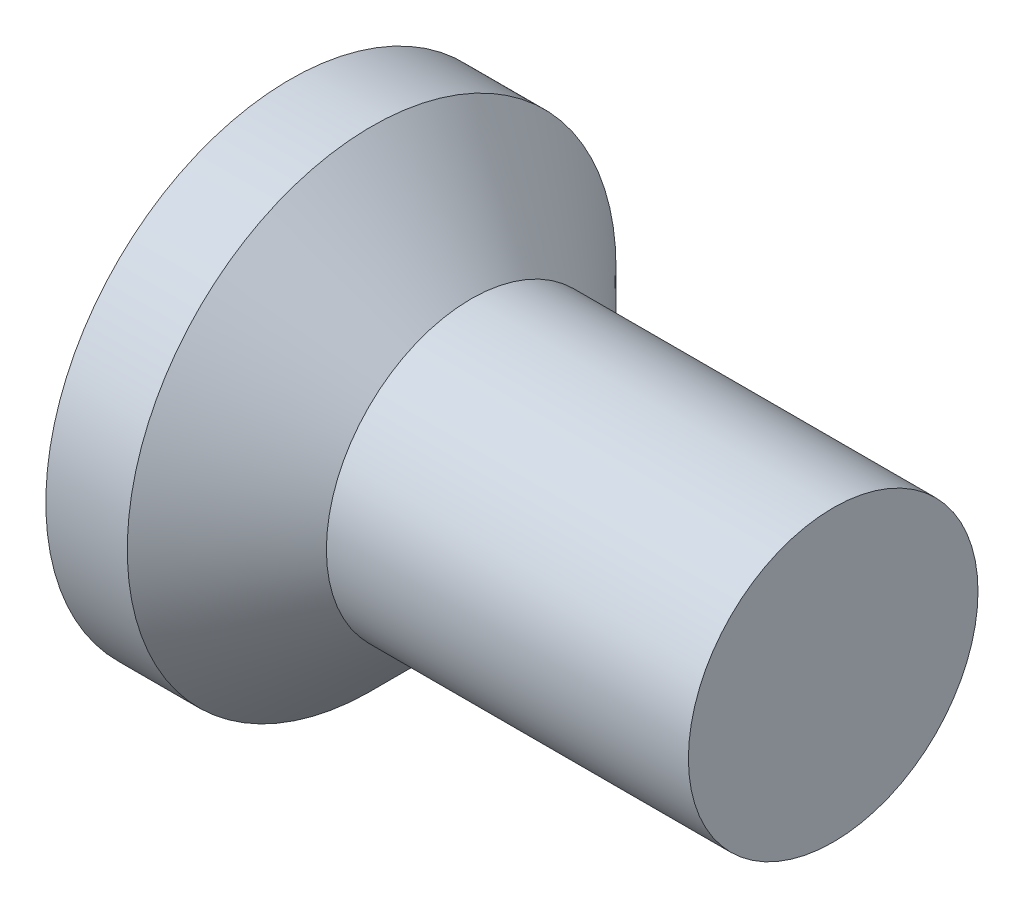
ISO-10303-21;
HEADER;
FILE_DESCRIPTION(('STEP AP214'),'2;1');
FILE_NAME('part.step','',(''),(''),'','','');
FILE_SCHEMA(('AUTOMOTIVE_DESIGN { 1 0 10303 214 1 1 1 1 }'));
ENDSEC;
DATA;
#1=APPLICATION_CONTEXT('core data for automotive mechanical design processes');
#2=APPLICATION_PROTOCOL_DEFINITION('international standard','automotive_design',2000,#1);
#3=PRODUCT_CONTEXT('',#1,'mechanical');
#4=PRODUCT('Part','Part','',(#3));
#5=PRODUCT_RELATED_PRODUCT_CATEGORY('part','',(#4));
#6=PRODUCT_DEFINITION_FORMATION('','',#4);
#7=PRODUCT_DEFINITION_CONTEXT('part definition',#1,'design');
#8=PRODUCT_DEFINITION('design','',#6,#7);
#9=PRODUCT_DEFINITION_SHAPE('','',#8);
#10=(LENGTH_UNIT() NAMED_UNIT(*) SI_UNIT(.MILLI.,.METRE.));
#11=(NAMED_UNIT(*) PLANE_ANGLE_UNIT() SI_UNIT($,.RADIAN.));
#12=(NAMED_UNIT(*) SI_UNIT($,.STERADIAN.) SOLID_ANGLE_UNIT());
#13=UNCERTAINTY_MEASURE_WITH_UNIT(LENGTH_MEASURE(1.E-05),#10,'distance_accuracy_value','');
#14=(GEOMETRIC_REPRESENTATION_CONTEXT(3) GLOBAL_UNCERTAINTY_ASSIGNED_CONTEXT((#13)) GLOBAL_UNIT_ASSIGNED_CONTEXT((#10,
#11,#12)) REPRESENTATION_CONTEXT('',''));
#15=CARTESIAN_POINT('',(0.,0.,0.));
#16=DIRECTION('',(0.,0.,1.));
#17=DIRECTION('',(1.,0.,0.));
#18=AXIS2_PLACEMENT_3D('',#15,#16,#17);
#19=CARTESIAN_POINT('',(0.,1.34999999999999,0.));
#20=DIRECTION('',(-1.,0.,0.));
#21=DIRECTION('',(0.,0.,1.));
#22=AXIS2_PLACEMENT_3D('',#19,#20,#21);
#23=PLANE('',#22);
#24=CARTESIAN_POINT('',(0.,0.,0.));
#25=DIRECTION('',(1.,0.,0.));
#26=DIRECTION('',(0.,0.,-1.));
#27=AXIS2_PLACEMENT_3D('',#24,#25,#26);
#28=CIRCLE('',#27,1.34999999999999);
#29=CARTESIAN_POINT('',(0.,0.,-1.34999999999999));
#30=VERTEX_POINT('',#29);
#31=EDGE_CURVE('E186',#30,#30,#28,.T.);
#32=ORIENTED_EDGE('',*,*,#31,.F.);
#33=EDGE_LOOP('',(#32));
#34=FACE_BOUND('',#33,.T.);
#35=DIRECTION('',(0.,1.,0.));
#36=VECTOR('',#35,1.);
#37=CARTESIAN_POINT('',(0.,-0.16,-0.16));
#38=LINE('',#37,#36);
#39=CARTESIAN_POINT('',(0.,-0.8,-0.16));
#40=VERTEX_POINT('',#39);
#41=CARTESIAN_POINT('',(0.,-0.46,-0.16));
#42=VERTEX_POINT('',#41);
#43=EDGE_CURVE('E312',#40,#42,#38,.T.);
#44=ORIENTED_EDGE('',*,*,#43,.T.);
#45=CARTESIAN_POINT('',(0.,-0.46,-0.46));
#46=DIRECTION('',(-1.,0.,0.));
#47=DIRECTION('',(0.,0.,1.));
#48=AXIS2_PLACEMENT_3D('',#45,#46,#47);
#49=CIRCLE('',#48,0.3);
#50=CARTESIAN_POINT('',(0.,-0.16,-0.46));
#51=VERTEX_POINT('',#50);
#52=EDGE_CURVE('E191',#42,#51,#49,.T.);
#53=ORIENTED_EDGE('',*,*,#52,.T.);
#54=DIRECTION('',(0.,0.,-1.));
#55=VECTOR('',#54,1.);
#56=CARTESIAN_POINT('',(0.,-0.16,-0.16));
#57=LINE('',#56,#55);
#58=CARTESIAN_POINT('',(0.,-0.16,-0.8));
#59=VERTEX_POINT('',#58);
#60=EDGE_CURVE('E314',#51,#59,#57,.T.);
#61=ORIENTED_EDGE('',*,*,#60,.T.);
#62=DIRECTION('',(0.,1.,0.));
#63=VECTOR('',#62,1.);
#64=CARTESIAN_POINT('',(0.,0.16,-0.8));
#65=LINE('',#64,#63);
#66=CARTESIAN_POINT('',(0.,0.16,-0.8));
#67=VERTEX_POINT('',#66);
#68=EDGE_CURVE('E316',#59,#67,#65,.T.);
#69=ORIENTED_EDGE('',*,*,#68,.T.);
#70=DIRECTION('',(0.,0.,1.));
#71=VECTOR('',#70,1.);
#72=CARTESIAN_POINT('',(0.,0.16,-0.16));
#73=LINE('',#72,#71);
#74=CARTESIAN_POINT('',(0.,0.16,-0.46));
#75=VERTEX_POINT('',#74);
#76=EDGE_CURVE('E319',#67,#75,#73,.T.);
#77=ORIENTED_EDGE('',*,*,#76,.T.);
#78=CARTESIAN_POINT('',(0.,0.46,-0.46));
#79=DIRECTION('',(-1.,0.,0.));
#80=DIRECTION('',(0.,0.,1.));
#81=AXIS2_PLACEMENT_3D('',#78,#79,#80);
#82=CIRCLE('',#81,0.3);
#83=CARTESIAN_POINT('',(0.,0.46,-0.16));
#84=VERTEX_POINT('',#83);
#85=EDGE_CURVE('E189',#75,#84,#82,.T.);
#86=ORIENTED_EDGE('',*,*,#85,.T.);
#87=DIRECTION('',(0.,1.,0.));
#88=VECTOR('',#87,1.);
#89=CARTESIAN_POINT('',(0.,0.16,-0.16));
#90=LINE('',#89,#88);
#91=CARTESIAN_POINT('',(0.,0.8,-0.16));
#92=VERTEX_POINT('',#91);
#93=EDGE_CURVE('E322',#84,#92,#90,.T.);
#94=ORIENTED_EDGE('',*,*,#93,.T.);
#95=DIRECTION('',(0.,0.,1.));
#96=VECTOR('',#95,1.);
#97=CARTESIAN_POINT('',(0.,0.8,-0.16));
#98=LINE('',#97,#96);
#99=CARTESIAN_POINT('',(0.,0.8,0.16));
#100=VERTEX_POINT('',#99);
#101=EDGE_CURVE('E324',#92,#100,#98,.T.);
#102=ORIENTED_EDGE('',*,*,#101,.T.);
#103=DIRECTION('',(0.,-1.,0.));
#104=VECTOR('',#103,1.);
#105=CARTESIAN_POINT('',(0.,0.16,0.16));
#106=LINE('',#105,#104);
#107=CARTESIAN_POINT('',(0.,0.46,0.16));
#108=VERTEX_POINT('',#107);
#109=EDGE_CURVE('E327',#100,#108,#106,.T.);
#110=ORIENTED_EDGE('',*,*,#109,.T.);
#111=CARTESIAN_POINT('',(0.,0.46,0.46));
#112=DIRECTION('',(-1.,0.,0.));
#113=DIRECTION('',(0.,0.,1.));
#114=AXIS2_PLACEMENT_3D('',#111,#112,#113);
#115=CIRCLE('',#114,0.3);
#116=CARTESIAN_POINT('',(0.,0.16,0.46));
#117=VERTEX_POINT('',#116);
#118=EDGE_CURVE('E154',#108,#117,#115,.T.);
#119=ORIENTED_EDGE('',*,*,#118,.T.);
#120=DIRECTION('',(0.,0.,1.));
#121=VECTOR('',#120,1.);
#122=CARTESIAN_POINT('',(0.,0.16,0.16));
#123=LINE('',#122,#121);
#124=CARTESIAN_POINT('',(0.,0.16,0.8));
#125=VERTEX_POINT('',#124);
#126=EDGE_CURVE('E148',#117,#125,#123,.T.);
#127=ORIENTED_EDGE('',*,*,#126,.T.);
#128=DIRECTION('',(0.,-1.,0.));
#129=VECTOR('',#128,1.);
#130=CARTESIAN_POINT('',(0.,0.16,0.8));
#131=LINE('',#130,#129);
#132=CARTESIAN_POINT('',(0.,-0.16,0.8));
#133=VERTEX_POINT('',#132);
#134=EDGE_CURVE('E152',#125,#133,#131,.T.);
#135=ORIENTED_EDGE('',*,*,#134,.T.);
#136=DIRECTION('',(0.,0.,-1.));
#137=VECTOR('',#136,1.);
#138=CARTESIAN_POINT('',(0.,-0.16,0.16));
#139=LINE('',#138,#137);
#140=CARTESIAN_POINT('',(0.,-0.16,0.46));
#141=VERTEX_POINT('',#140);
#142=EDGE_CURVE('E166',#133,#141,#139,.T.);
#143=ORIENTED_EDGE('',*,*,#142,.T.);
#144=CARTESIAN_POINT('',(0.,-0.46,0.46));
#145=DIRECTION('',(-1.,0.,0.));
#146=DIRECTION('',(0.,0.,1.));
#147=AXIS2_PLACEMENT_3D('',#144,#145,#146);
#148=CIRCLE('',#147,0.3);
#149=CARTESIAN_POINT('',(0.,-0.46,0.16));
#150=VERTEX_POINT('',#149);
#151=EDGE_CURVE('E185',#141,#150,#148,.T.);
#152=ORIENTED_EDGE('',*,*,#151,.T.);
#153=DIRECTION('',(0.,-1.,0.));
#154=VECTOR('',#153,1.);
#155=CARTESIAN_POINT('',(0.,-0.16,0.16));
#156=LINE('',#155,#154);
#157=CARTESIAN_POINT('',(0.,-0.8,0.159999999999999));
#158=VERTEX_POINT('',#157);
#159=EDGE_CURVE('E307',#150,#158,#156,.T.);
#160=ORIENTED_EDGE('',*,*,#159,.T.);
#161=DIRECTION('',(0.,0.,-1.));
#162=VECTOR('',#161,1.);
#163=CARTESIAN_POINT('',(0.,-0.8,-0.16));
#164=LINE('',#163,#162);
#165=EDGE_CURVE('E309',#158,#40,#164,.T.);
#166=ORIENTED_EDGE('',*,*,#165,.T.);
#167=EDGE_LOOP('',(#44,#53,#61,#69,#77,#86,#94,#102,#110,#119,#127,#135,#143,#152,#160,#166));
#168=FACE_BOUND('',#167,.T.);
#169=ADVANCED_FACE('F35',(#34,#168),#23,.T.);
#170=CARTESIAN_POINT('',(3.,0.799999999999993,0.));
#171=DIRECTION('',(1.,0.,0.));
#172=DIRECTION('',(0.,0.,-1.));
#173=AXIS2_PLACEMENT_3D('',#170,#171,#172);
#174=PLANE('',#173);
#175=CARTESIAN_POINT('',(3.,0.,0.));
#176=DIRECTION('',(1.,0.,0.));
#177=DIRECTION('',(0.,0.,-1.));
#178=AXIS2_PLACEMENT_3D('',#175,#176,#177);
#179=CIRCLE('',#178,0.799999999999993);
#180=CARTESIAN_POINT('',(3.,0.,-0.799999999999993));
#181=VERTEX_POINT('',#180);
#182=EDGE_CURVE('E172',#181,#181,#179,.T.);
#183=ORIENTED_EDGE('',*,*,#182,.T.);
#184=EDGE_LOOP('',(#183));
#185=FACE_BOUND('',#184,.T.);
#186=ADVANCED_FACE('F239',(#185),#174,.T.);
#187=CARTESIAN_POINT('',(4.51581291088132,0.,0.));
#188=DIRECTION('',(1.,0.,0.));
#189=DIRECTION('',(0.,0.,-1.));
#190=AXIS2_PLACEMENT_3D('',#187,#188,#189);
#191=CYLINDRICAL_SURFACE('',#190,1.34999999999999);
#192=ORIENTED_EDGE('',*,*,#31,.T.);
#193=EDGE_LOOP('',(#192));
#194=FACE_BOUND('',#193,.T.);
#195=CARTESIAN_POINT('',(0.450000000000002,0.,0.));
#196=DIRECTION('',(1.,0.,0.));
#197=DIRECTION('',(0.,0.,-1.));
#198=AXIS2_PLACEMENT_3D('',#195,#196,#197);
#199=CIRCLE('',#198,1.34999999999999);
#200=CARTESIAN_POINT('',(0.450000000000002,0.,-1.34999999999999));
#201=VERTEX_POINT('',#200);
#202=EDGE_CURVE('E331',#201,#201,#199,.T.);
#203=ORIENTED_EDGE('',*,*,#202,.F.);
#204=EDGE_LOOP('',(#203));
#205=FACE_BOUND('',#204,.T.);
#206=ADVANCED_FACE('F245',(#194,#205),#191,.T.);
#207=CARTESIAN_POINT('',(1.,0.,0.));
#208=DIRECTION('',(-1.,0.,0.));
#209=DIRECTION('',(0.,0.,1.));
#210=AXIS2_PLACEMENT_3D('',#207,#208,#209);
#211=CONICAL_SURFACE('',#210,0.799999999999993,0.785398163397449);
#212=ORIENTED_EDGE('',*,*,#202,.T.);
#213=EDGE_LOOP('',(#212));
#214=FACE_BOUND('',#213,.T.);
#215=CARTESIAN_POINT('',(1.,0.,0.));
#216=DIRECTION('',(1.,0.,0.));
#217=DIRECTION('',(0.,0.,-1.));
#218=AXIS2_PLACEMENT_3D('',#215,#216,#217);
#219=CIRCLE('',#218,0.799999999999993);
#220=CARTESIAN_POINT('',(1.,0.,-0.799999999999993));
#221=VERTEX_POINT('',#220);
#222=EDGE_CURVE('E175',#221,#221,#219,.T.);
#223=ORIENTED_EDGE('',*,*,#222,.F.);
#224=EDGE_LOOP('',(#223));
#225=FACE_BOUND('',#224,.T.);
#226=ADVANCED_FACE('F367',(#214,#225),#211,.T.);
#227=CARTESIAN_POINT('',(4.51581291088132,0.,0.));
#228=DIRECTION('',(1.,0.,0.));
#229=DIRECTION('',(0.,0.,-1.));
#230=AXIS2_PLACEMENT_3D('',#227,#228,#229);
#231=CYLINDRICAL_SURFACE('',#230,0.799999999999993);
#232=ORIENTED_EDGE('',*,*,#222,.T.);
#233=EDGE_LOOP('',(#232));
#234=FACE_BOUND('',#233,.T.);
#235=ORIENTED_EDGE('',*,*,#182,.F.);
#236=EDGE_LOOP('',(#235));
#237=FACE_BOUND('',#236,.T.);
#238=ADVANCED_FACE('F365',(#234,#237),#231,.T.);
#239=CARTESIAN_POINT('',(0.5,0.16,0.16));
#240=DIRECTION('',(0.,-1.,0.));
#241=DIRECTION('',(0.,0.,-1.));
#242=AXIS2_PLACEMENT_3D('',#239,#240,#241);
#243=PLANE('',#242);
#244=ORIENTED_EDGE('',*,*,#126,.F.);
#245=DIRECTION('',(-1.,0.,0.));
#246=VECTOR('',#245,1.);
#247=CARTESIAN_POINT('',(0.5,0.16,0.46));
#248=LINE('',#247,#246);
#249=CARTESIAN_POINT('',(0.5,0.16,0.46));
#250=VERTEX_POINT('',#249);
#251=EDGE_CURVE('E203',#117,#250,#248,.F.);
#252=ORIENTED_EDGE('',*,*,#251,.T.);
#253=DIRECTION('',(0.,0.,1.));
#254=VECTOR('',#253,1.);
#255=CARTESIAN_POINT('',(0.5,0.16,0.16));
#256=LINE('',#255,#254);
#257=CARTESIAN_POINT('',(0.5,0.16,0.511324865405187));
#258=VERTEX_POINT('',#257);
#259=EDGE_CURVE('E170',#250,#258,#256,.T.);
#260=ORIENTED_EDGE('',*,*,#259,.T.);
#261=DIRECTION('',(-0.866025403784438,0.,0.500000000000001));
#262=VECTOR('',#261,1.);
#263=CARTESIAN_POINT('',(0.,0.16,0.8));
#264=LINE('',#263,#262);
#265=EDGE_CURVE('E162',#258,#125,#264,.T.);
#266=ORIENTED_EDGE('',*,*,#265,.T.);
#267=EDGE_LOOP('',(#244,#252,#260,#266));
#268=FACE_BOUND('',#267,.T.);
#269=ADVANCED_FACE('F168',(#268),#243,.T.);
#270=CARTESIAN_POINT('',(0.,0.16,0.8));
#271=DIRECTION('',(-0.500000000000001,0.,-0.866025403784438));
#272=DIRECTION('',(-0.866025403784438,0.,0.500000000000001));
#273=AXIS2_PLACEMENT_3D('',#270,#271,#272);
#274=PLANE('',#273);
#275=ORIENTED_EDGE('',*,*,#134,.F.);
#276=ORIENTED_EDGE('',*,*,#265,.F.);
#277=DIRECTION('',(0.,-1.,0.));
#278=VECTOR('',#277,1.);
#279=CARTESIAN_POINT('',(0.5,0.16,0.511324865405187));
#280=LINE('',#279,#278);
#281=CARTESIAN_POINT('',(0.5,-0.16,0.511324865405187));
#282=VERTEX_POINT('',#281);
#283=EDGE_CURVE('E181',#258,#282,#280,.T.);
#284=ORIENTED_EDGE('',*,*,#283,.T.);
#285=DIRECTION('',(-0.866025403784438,0.,0.500000000000001));
#286=VECTOR('',#285,1.);
#287=CARTESIAN_POINT('',(0.65212812921102,-0.16,0.42349364905389));
#288=LINE('',#287,#286);
#289=EDGE_CURVE('E164',#282,#133,#288,.T.);
#290=ORIENTED_EDGE('',*,*,#289,.T.);
#291=EDGE_LOOP('',(#275,#276,#284,#290));
#292=FACE_BOUND('',#291,.T.);
#293=ADVANCED_FACE('F161',(#292),#274,.T.);
#294=CARTESIAN_POINT('',(0.5,-0.16,0.16));
#295=DIRECTION('',(0.,1.,0.));
#296=DIRECTION('',(0.,0.,1.));
#297=AXIS2_PLACEMENT_3D('',#294,#295,#296);
#298=PLANE('',#297);
#299=DIRECTION('',(0.,0.,-1.));
#300=VECTOR('',#299,1.);
#301=CARTESIAN_POINT('',(0.5,-0.16,0.16));
#302=LINE('',#301,#300);
#303=CARTESIAN_POINT('',(0.5,-0.16,0.46));
#304=VERTEX_POINT('',#303);
#305=EDGE_CURVE('E353',#282,#304,#302,.T.);
#306=ORIENTED_EDGE('',*,*,#305,.T.);
#307=DIRECTION('',(-1.,0.,0.));
#308=VECTOR('',#307,1.);
#309=CARTESIAN_POINT('',(0.5,-0.16,0.46));
#310=LINE('',#309,#308);
#311=EDGE_CURVE('E205',#304,#141,#310,.T.);
#312=ORIENTED_EDGE('',*,*,#311,.T.);
#313=ORIENTED_EDGE('',*,*,#142,.F.);
#314=ORIENTED_EDGE('',*,*,#289,.F.);
#315=EDGE_LOOP('',(#306,#312,#313,#314));
#316=FACE_BOUND('',#315,.T.);
#317=ADVANCED_FACE('F259',(#316),#298,.T.);
#318=CARTESIAN_POINT('',(0.5,-0.16,0.16));
#319=DIRECTION('',(0.,0.,-1.));
#320=DIRECTION('',(0.,1.,0.));
#321=AXIS2_PLACEMENT_3D('',#318,#319,#320);
#322=PLANE('',#321);
#323=ORIENTED_EDGE('',*,*,#159,.F.);
#324=DIRECTION('',(-1.,0.,0.));
#325=VECTOR('',#324,1.);
#326=CARTESIAN_POINT('',(0.5,-0.46,0.16));
#327=LINE('',#326,#325);
#328=CARTESIAN_POINT('',(0.5,-0.46,0.16));
#329=VERTEX_POINT('',#328);
#330=EDGE_CURVE('E50',#150,#329,#327,.F.);
#331=ORIENTED_EDGE('',*,*,#330,.T.);
#332=DIRECTION('',(0.,-1.,0.));
#333=VECTOR('',#332,1.);
#334=CARTESIAN_POINT('',(0.5,-0.16,0.16));
#335=LINE('',#334,#333);
#336=CARTESIAN_POINT('',(0.5,-0.511324865405187,0.16));
#337=VERTEX_POINT('',#336);
#338=EDGE_CURVE('E296',#329,#337,#335,.T.);
#339=ORIENTED_EDGE('',*,*,#338,.T.);
#340=DIRECTION('',(-0.866025403784438,-0.500000000000001,0.));
#341=VECTOR('',#340,1.);
#342=CARTESIAN_POINT('',(0.,-0.8,0.159999999999999));
#343=LINE('',#342,#341);
#344=EDGE_CURVE('E177',#337,#158,#343,.T.);
#345=ORIENTED_EDGE('',*,*,#344,.T.);
#346=EDGE_LOOP('',(#323,#331,#339,#345));
#347=FACE_BOUND('',#346,.T.);
#348=ADVANCED_FACE('F264',(#347),#322,.T.);
#349=CARTESIAN_POINT('',(0.,-0.8,-0.16));
#350=DIRECTION('',(-0.500000000000001,0.866025403784438,0.));
#351=DIRECTION('',(-0.866025403784438,-0.500000000000001,0.));
#352=AXIS2_PLACEMENT_3D('',#349,#350,#351);
#353=PLANE('',#352);
#354=ORIENTED_EDGE('',*,*,#165,.F.);
#355=ORIENTED_EDGE('',*,*,#344,.F.);
#356=DIRECTION('',(0.,0.,-1.));
#357=VECTOR('',#356,1.);
#358=CARTESIAN_POINT('',(0.5,-0.511324865405187,-0.16));
#359=LINE('',#358,#357);
#360=CARTESIAN_POINT('',(0.5,-0.511324865405187,-0.16));
#361=VERTEX_POINT('',#360);
#362=EDGE_CURVE('E292',#337,#361,#359,.T.);
#363=ORIENTED_EDGE('',*,*,#362,.T.);
#364=DIRECTION('',(-0.866025403784438,-0.500000000000001,0.));
#365=VECTOR('',#364,1.);
#366=CARTESIAN_POINT('',(0.65212812921102,-0.42349364905389,-0.16));
#367=LINE('',#366,#365);
#368=EDGE_CURVE('E291',#361,#40,#367,.T.);
#369=ORIENTED_EDGE('',*,*,#368,.T.);
#370=EDGE_LOOP('',(#354,#355,#363,#369));
#371=FACE_BOUND('',#370,.T.);
#372=ADVANCED_FACE('F260',(#371),#353,.T.);
#373=CARTESIAN_POINT('',(0.5,-0.16,-0.16));
#374=DIRECTION('',(0.,0.,1.));
#375=DIRECTION('',(0.,-1.,0.));
#376=AXIS2_PLACEMENT_3D('',#373,#374,#375);
#377=PLANE('',#376);
#378=DIRECTION('',(0.,1.,0.));
#379=VECTOR('',#378,1.);
#380=CARTESIAN_POINT('',(0.5,-0.16,-0.16));
#381=LINE('',#380,#379);
#382=CARTESIAN_POINT('',(0.5,-0.46,-0.16));
#383=VERTEX_POINT('',#382);
#384=EDGE_CURVE('E285',#361,#383,#381,.T.);
#385=ORIENTED_EDGE('',*,*,#384,.T.);
#386=DIRECTION('',(-1.,0.,0.));
#387=VECTOR('',#386,1.);
#388=CARTESIAN_POINT('',(0.5,-0.46,-0.16));
#389=LINE('',#388,#387);
#390=EDGE_CURVE('E182',#383,#42,#389,.T.);
#391=ORIENTED_EDGE('',*,*,#390,.T.);
#392=ORIENTED_EDGE('',*,*,#43,.F.);
#393=ORIENTED_EDGE('',*,*,#368,.F.);
#394=EDGE_LOOP('',(#385,#391,#392,#393));
#395=FACE_BOUND('',#394,.T.);
#396=ADVANCED_FACE('F263',(#395),#377,.T.);
#397=CARTESIAN_POINT('',(0.5,-0.16,-0.16));
#398=DIRECTION('',(0.,1.,0.));
#399=DIRECTION('',(0.,0.,1.));
#400=AXIS2_PLACEMENT_3D('',#397,#398,#399);
#401=PLANE('',#400);
#402=ORIENTED_EDGE('',*,*,#60,.F.);
#403=DIRECTION('',(-1.,0.,0.));
#404=VECTOR('',#403,1.);
#405=CARTESIAN_POINT('',(0.5,-0.16,-0.46));
#406=LINE('',#405,#404);
#407=CARTESIAN_POINT('',(0.5,-0.16,-0.46));
#408=VERTEX_POINT('',#407);
#409=EDGE_CURVE('E193',#51,#408,#406,.F.);
#410=ORIENTED_EDGE('',*,*,#409,.T.);
#411=DIRECTION('',(0.,0.,-1.));
#412=VECTOR('',#411,1.);
#413=CARTESIAN_POINT('',(0.5,-0.16,-0.16));
#414=LINE('',#413,#412);
#415=CARTESIAN_POINT('',(0.5,-0.16,-0.511324865405187));
#416=VERTEX_POINT('',#415);
#417=EDGE_CURVE('E287',#408,#416,#414,.T.);
#418=ORIENTED_EDGE('',*,*,#417,.T.);
#419=DIRECTION('',(-0.866025403784438,0.,-0.500000000000001));
#420=VECTOR('',#419,1.);
#421=CARTESIAN_POINT('',(0.,-0.16,-0.8));
#422=LINE('',#421,#420);
#423=EDGE_CURVE('E343',#416,#59,#422,.T.);
#424=ORIENTED_EDGE('',*,*,#423,.T.);
#425=EDGE_LOOP('',(#402,#410,#418,#424));
#426=FACE_BOUND('',#425,.T.);
#427=ADVANCED_FACE('F270',(#426),#401,.T.);
#428=CARTESIAN_POINT('',(0.,0.16,-0.8));
#429=DIRECTION('',(-0.500000000000001,0.,0.866025403784438));
#430=DIRECTION('',(0.866025403784438,0.,0.500000000000001));
#431=AXIS2_PLACEMENT_3D('',#428,#429,#430);
#432=PLANE('',#431);
#433=ORIENTED_EDGE('',*,*,#68,.F.);
#434=ORIENTED_EDGE('',*,*,#423,.F.);
#435=DIRECTION('',(0.,1.,0.));
#436=VECTOR('',#435,1.);
#437=CARTESIAN_POINT('',(0.5,0.16,-0.511324865405187));
#438=LINE('',#437,#436);
#439=CARTESIAN_POINT('',(0.5,0.16,-0.511324865405187));
#440=VERTEX_POINT('',#439);
#441=EDGE_CURVE('E294',#416,#440,#438,.T.);
#442=ORIENTED_EDGE('',*,*,#441,.T.);
#443=DIRECTION('',(-0.866025403784438,0.,-0.500000000000001));
#444=VECTOR('',#443,1.);
#445=CARTESIAN_POINT('',(0.65212812921102,0.16,-0.42349364905389));
#446=LINE('',#445,#444);
#447=EDGE_CURVE('E341',#440,#67,#446,.T.);
#448=ORIENTED_EDGE('',*,*,#447,.T.);
#449=EDGE_LOOP('',(#433,#434,#442,#448));
#450=FACE_BOUND('',#449,.T.);
#451=ADVANCED_FACE('F266',(#450),#432,.T.);
#452=CARTESIAN_POINT('',(0.5,0.16,-0.16));
#453=DIRECTION('',(0.,-1.,0.));
#454=DIRECTION('',(0.,0.,-1.));
#455=AXIS2_PLACEMENT_3D('',#452,#453,#454);
#456=PLANE('',#455);
#457=DIRECTION('',(0.,0.,1.));
#458=VECTOR('',#457,1.);
#459=CARTESIAN_POINT('',(0.5,0.16,-0.16));
#460=LINE('',#459,#458);
#461=CARTESIAN_POINT('',(0.5,0.16,-0.46));
#462=VERTEX_POINT('',#461);
#463=EDGE_CURVE('E301',#440,#462,#460,.T.);
#464=ORIENTED_EDGE('',*,*,#463,.T.);
#465=DIRECTION('',(-1.,0.,0.));
#466=VECTOR('',#465,1.);
#467=CARTESIAN_POINT('',(0.5,0.16,-0.46));
#468=LINE('',#467,#466);
#469=EDGE_CURVE('E195',#462,#75,#468,.T.);
#470=ORIENTED_EDGE('',*,*,#469,.T.);
#471=ORIENTED_EDGE('',*,*,#76,.F.);
#472=ORIENTED_EDGE('',*,*,#447,.F.);
#473=EDGE_LOOP('',(#464,#470,#471,#472));
#474=FACE_BOUND('',#473,.T.);
#475=ADVANCED_FACE('F269',(#474),#456,.T.);
#476=CARTESIAN_POINT('',(0.5,0.16,-0.16));
#477=DIRECTION('',(0.,0.,1.));
#478=DIRECTION('',(0.,-1.,0.));
#479=AXIS2_PLACEMENT_3D('',#476,#477,#478);
#480=PLANE('',#479);
#481=ORIENTED_EDGE('',*,*,#93,.F.);
#482=DIRECTION('',(-1.,0.,0.));
#483=VECTOR('',#482,1.);
#484=CARTESIAN_POINT('',(0.5,0.46,-0.16));
#485=LINE('',#484,#483);
#486=CARTESIAN_POINT('',(0.5,0.46,-0.16));
#487=VERTEX_POINT('',#486);
#488=EDGE_CURVE('E198',#84,#487,#485,.F.);
#489=ORIENTED_EDGE('',*,*,#488,.T.);
#490=DIRECTION('',(0.,1.,0.));
#491=VECTOR('',#490,1.);
#492=CARTESIAN_POINT('',(0.5,0.16,-0.16));
#493=LINE('',#492,#491);
#494=CARTESIAN_POINT('',(0.5,0.511324865405187,-0.16));
#495=VERTEX_POINT('',#494);
#496=EDGE_CURVE('E304',#487,#495,#493,.T.);
#497=ORIENTED_EDGE('',*,*,#496,.T.);
#498=DIRECTION('',(-0.866025403784438,0.500000000000001,0.));
#499=VECTOR('',#498,1.);
#500=CARTESIAN_POINT('',(0.,0.8,-0.16));
#501=LINE('',#500,#499);
#502=EDGE_CURVE('E337',#495,#92,#501,.T.);
#503=ORIENTED_EDGE('',*,*,#502,.T.);
#504=EDGE_LOOP('',(#481,#489,#497,#503));
#505=FACE_BOUND('',#504,.T.);
#506=ADVANCED_FACE('F255',(#505),#480,.T.);
#507=CARTESIAN_POINT('',(0.,0.8,-0.16));
#508=DIRECTION('',(-0.500000000000001,-0.866025403784438,0.));
#509=DIRECTION('',(0.866025403784438,-0.500000000000001,0.));
#510=AXIS2_PLACEMENT_3D('',#507,#508,#509);
#511=PLANE('',#510);
#512=ORIENTED_EDGE('',*,*,#101,.F.);
#513=ORIENTED_EDGE('',*,*,#502,.F.);
#514=DIRECTION('',(0.,0.,1.));
#515=VECTOR('',#514,1.);
#516=CARTESIAN_POINT('',(0.5,0.511324865405187,-0.16));
#517=LINE('',#516,#515);
#518=CARTESIAN_POINT('',(0.5,0.511324865405187,0.16));
#519=VERTEX_POINT('',#518);
#520=EDGE_CURVE('E225',#495,#519,#517,.T.);
#521=ORIENTED_EDGE('',*,*,#520,.T.);
#522=DIRECTION('',(-0.866025403784438,0.500000000000001,0.));
#523=VECTOR('',#522,1.);
#524=CARTESIAN_POINT('',(0.65212812921102,0.42349364905389,0.16));
#525=LINE('',#524,#523);
#526=EDGE_CURVE('E224',#519,#100,#525,.T.);
#527=ORIENTED_EDGE('',*,*,#526,.T.);
#528=EDGE_LOOP('',(#512,#513,#521,#527));
#529=FACE_BOUND('',#528,.T.);
#530=ADVANCED_FACE('F252',(#529),#511,.T.);
#531=CARTESIAN_POINT('',(0.5,0.16,0.16));
#532=DIRECTION('',(0.,0.,-1.));
#533=DIRECTION('',(-1.,0.,0.));
#534=AXIS2_PLACEMENT_3D('',#531,#532,#533);
#535=PLANE('',#534);
#536=DIRECTION('',(0.,-1.,0.));
#537=VECTOR('',#536,1.);
#538=CARTESIAN_POINT('',(0.5,0.16,0.16));
#539=LINE('',#538,#537);
#540=CARTESIAN_POINT('',(0.5,0.46,0.16));
#541=VERTEX_POINT('',#540);
#542=EDGE_CURVE('E217',#519,#541,#539,.T.);
#543=ORIENTED_EDGE('',*,*,#542,.T.);
#544=DIRECTION('',(-1.,0.,0.));
#545=VECTOR('',#544,1.);
#546=CARTESIAN_POINT('',(0.5,0.46,0.16));
#547=LINE('',#546,#545);
#548=EDGE_CURVE('E200',#541,#108,#547,.T.);
#549=ORIENTED_EDGE('',*,*,#548,.T.);
#550=ORIENTED_EDGE('',*,*,#109,.F.);
#551=ORIENTED_EDGE('',*,*,#526,.F.);
#552=EDGE_LOOP('',(#543,#549,#550,#551));
#553=FACE_BOUND('',#552,.T.);
#554=ADVANCED_FACE('F222',(#553),#535,.T.);
#555=CARTESIAN_POINT('',(0.5,0.16,-0.16));
#556=DIRECTION('',(-1.,0.,0.));
#557=DIRECTION('',(0.,0.,1.));
#558=AXIS2_PLACEMENT_3D('',#555,#556,#557);
#559=PLANE('',#558);
#560=ORIENTED_EDGE('',*,*,#259,.F.);
#561=CARTESIAN_POINT('',(0.5,0.46,0.46));
#562=DIRECTION('',(-1.,0.,0.));
#563=DIRECTION('',(0.,0.,1.));
#564=AXIS2_PLACEMENT_3D('',#561,#562,#563);
#565=CIRCLE('',#564,0.3);
#566=EDGE_CURVE('E43',#250,#541,#565,.F.);
#567=ORIENTED_EDGE('',*,*,#566,.T.);
#568=ORIENTED_EDGE('',*,*,#542,.F.);
#569=ORIENTED_EDGE('',*,*,#520,.F.);
#570=ORIENTED_EDGE('',*,*,#496,.F.);
#571=CARTESIAN_POINT('',(0.5,0.46,-0.46));
#572=DIRECTION('',(-1.,0.,0.));
#573=DIRECTION('',(0.,0.,1.));
#574=AXIS2_PLACEMENT_3D('',#571,#572,#573);
#575=CIRCLE('',#574,0.3);
#576=EDGE_CURVE('E211',#487,#462,#575,.F.);
#577=ORIENTED_EDGE('',*,*,#576,.T.);
#578=ORIENTED_EDGE('',*,*,#463,.F.);
#579=ORIENTED_EDGE('',*,*,#441,.F.);
#580=ORIENTED_EDGE('',*,*,#417,.F.);
#581=CARTESIAN_POINT('',(0.5,-0.46,-0.46));
#582=DIRECTION('',(-1.,0.,0.));
#583=DIRECTION('',(0.,0.,1.));
#584=AXIS2_PLACEMENT_3D('',#581,#582,#583);
#585=CIRCLE('',#584,0.3);
#586=EDGE_CURVE('E209',#408,#383,#585,.F.);
#587=ORIENTED_EDGE('',*,*,#586,.T.);
#588=ORIENTED_EDGE('',*,*,#384,.F.);
#589=ORIENTED_EDGE('',*,*,#362,.F.);
#590=ORIENTED_EDGE('',*,*,#338,.F.);
#591=CARTESIAN_POINT('',(0.5,-0.46,0.46));
#592=DIRECTION('',(-1.,0.,0.));
#593=DIRECTION('',(0.,0.,1.));
#594=AXIS2_PLACEMENT_3D('',#591,#592,#593);
#595=CIRCLE('',#594,0.3);
#596=EDGE_CURVE('E11',#329,#304,#595,.F.);
#597=ORIENTED_EDGE('',*,*,#596,.T.);
#598=ORIENTED_EDGE('',*,*,#305,.F.);
#599=ORIENTED_EDGE('',*,*,#283,.F.);
#600=EDGE_LOOP('',(#560,#567,#568,#569,#570,#577,#578,#579,#580,#587,#588,#589,#590,#597,#598,#599));
#601=FACE_BOUND('',#600,.T.);
#602=ADVANCED_FACE('F215',(#601),#559,.T.);
#603=CARTESIAN_POINT('',(0.5,-0.46,-0.46));
#604=DIRECTION('',(-1.,0.,0.));
#605=DIRECTION('',(0.,0.,1.));
#606=AXIS2_PLACEMENT_3D('',#603,#604,#605);
#607=CYLINDRICAL_SURFACE('',#606,0.3);
#608=ORIENTED_EDGE('',*,*,#586,.F.);
#609=ORIENTED_EDGE('',*,*,#409,.F.);
#610=ORIENTED_EDGE('',*,*,#52,.F.);
#611=ORIENTED_EDGE('',*,*,#390,.F.);
#612=EDGE_LOOP('',(#608,#609,#610,#611));
#613=FACE_BOUND('',#612,.T.);
#614=ADVANCED_FACE('F235',(#613),#607,.T.);
#615=CARTESIAN_POINT('',(0.5,0.46,-0.46));
#616=DIRECTION('',(-1.,0.,0.));
#617=DIRECTION('',(0.,0.,1.));
#618=AXIS2_PLACEMENT_3D('',#615,#616,#617);
#619=CYLINDRICAL_SURFACE('',#618,0.3);
#620=ORIENTED_EDGE('',*,*,#576,.F.);
#621=ORIENTED_EDGE('',*,*,#488,.F.);
#622=ORIENTED_EDGE('',*,*,#85,.F.);
#623=ORIENTED_EDGE('',*,*,#469,.F.);
#624=EDGE_LOOP('',(#620,#621,#622,#623));
#625=FACE_BOUND('',#624,.T.);
#626=ADVANCED_FACE('F229',(#625),#619,.T.);
#627=CARTESIAN_POINT('',(0.5,0.46,0.46));
#628=DIRECTION('',(-1.,0.,0.));
#629=DIRECTION('',(0.,0.,1.));
#630=AXIS2_PLACEMENT_3D('',#627,#628,#629);
#631=CYLINDRICAL_SURFACE('',#630,0.3);
#632=ORIENTED_EDGE('',*,*,#566,.F.);
#633=ORIENTED_EDGE('',*,*,#251,.F.);
#634=ORIENTED_EDGE('',*,*,#118,.F.);
#635=ORIENTED_EDGE('',*,*,#548,.F.);
#636=EDGE_LOOP('',(#632,#633,#634,#635));
#637=FACE_BOUND('',#636,.T.);
#638=ADVANCED_FACE('F227',(#637),#631,.T.);
#639=CARTESIAN_POINT('',(0.5,-0.46,0.46));
#640=DIRECTION('',(-1.,0.,0.));
#641=DIRECTION('',(0.,0.,1.));
#642=AXIS2_PLACEMENT_3D('',#639,#640,#641);
#643=CYLINDRICAL_SURFACE('',#642,0.3);
#644=ORIENTED_EDGE('',*,*,#596,.F.);
#645=ORIENTED_EDGE('',*,*,#330,.F.);
#646=ORIENTED_EDGE('',*,*,#151,.F.);
#647=ORIENTED_EDGE('',*,*,#311,.F.);
#648=EDGE_LOOP('',(#644,#645,#646,#647));
#649=FACE_BOUND('',#648,.T.);
#650=ADVANCED_FACE('F37',(#649),#643,.T.);
#651=CLOSED_SHELL('',(#169,#186,#206,#226,#238,#269,#293,#317,#348,#372,#396,#427,#451,#475,
#506,#530,#554,#602,#614,#626,#638,#650));
#652=MANIFOLD_SOLID_BREP('B2',#651);
#653=ADVANCED_BREP_SHAPE_REPRESENTATION('',(#18,#652),#14);
#654=SHAPE_DEFINITION_REPRESENTATION(#9,#653);
ENDSEC;
END-ISO-10303-21;
